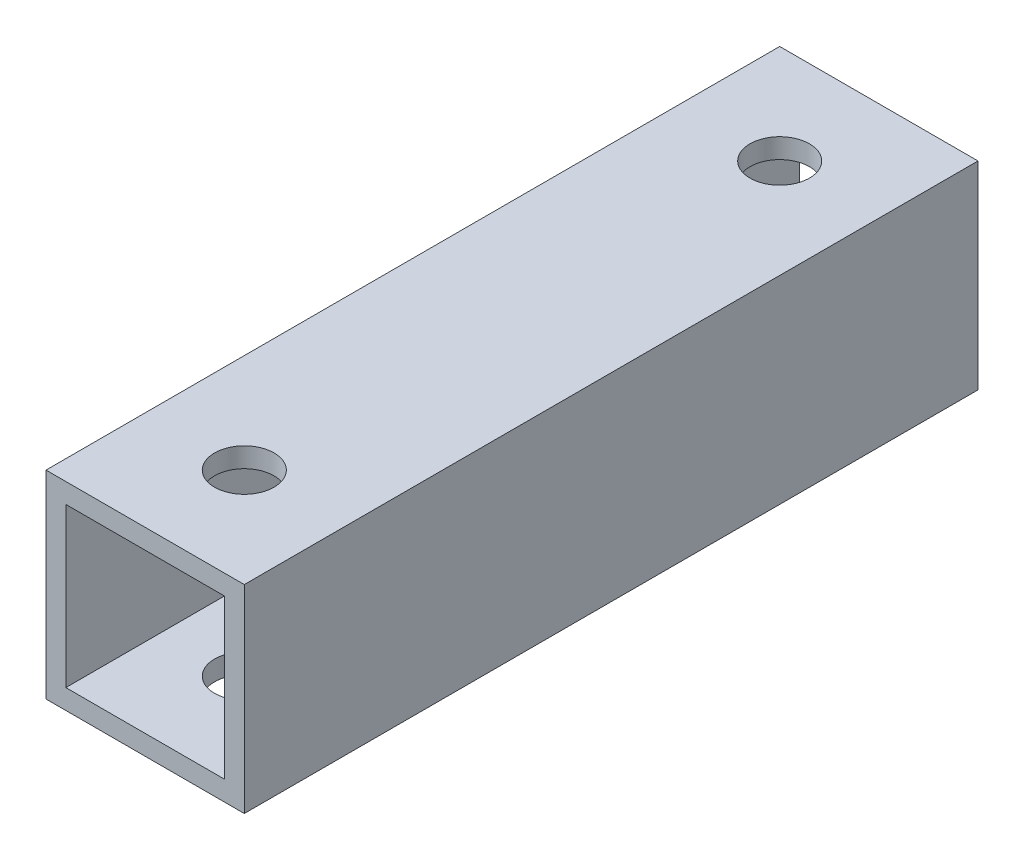
ISO-10303-21;
HEADER;
FILE_DESCRIPTION(('STEP AP214'),'2;1');
FILE_NAME('part.step','',(''),(''),'','','');
FILE_SCHEMA(('AUTOMOTIVE_DESIGN { 1 0 10303 214 1 1 1 1 }'));
ENDSEC;
DATA;
#1=APPLICATION_CONTEXT('core data for automotive mechanical design processes');
#2=APPLICATION_PROTOCOL_DEFINITION('international standard','automotive_design',2000,#1);
#3=PRODUCT_CONTEXT('',#1,'mechanical');
#4=PRODUCT('Part','Part','',(#3));
#5=PRODUCT_RELATED_PRODUCT_CATEGORY('part','',(#4));
#6=PRODUCT_DEFINITION_FORMATION('','',#4);
#7=PRODUCT_DEFINITION_CONTEXT('part definition',#1,'design');
#8=PRODUCT_DEFINITION('design','',#6,#7);
#9=PRODUCT_DEFINITION_SHAPE('','',#8);
#10=(LENGTH_UNIT() NAMED_UNIT(*) SI_UNIT(.MILLI.,.METRE.));
#11=(NAMED_UNIT(*) PLANE_ANGLE_UNIT() SI_UNIT($,.RADIAN.));
#12=(NAMED_UNIT(*) SI_UNIT($,.STERADIAN.) SOLID_ANGLE_UNIT());
#13=UNCERTAINTY_MEASURE_WITH_UNIT(LENGTH_MEASURE(1.E-05),#10,'distance_accuracy_value','');
#14=(GEOMETRIC_REPRESENTATION_CONTEXT(3) GLOBAL_UNCERTAINTY_ASSIGNED_CONTEXT((#13)) GLOBAL_UNIT_ASSIGNED_CONTEXT((#10,
#11,#12)) REPRESENTATION_CONTEXT('',''));
#15=CARTESIAN_POINT('',(0.,0.,0.));
#16=DIRECTION('',(0.,0.,1.));
#17=DIRECTION('',(1.,0.,0.));
#18=AXIS2_PLACEMENT_3D('',#15,#16,#17);
#19=CARTESIAN_POINT('',(0.,0.,37.));
#20=DIRECTION('',(0.,0.,1.));
#21=DIRECTION('',(1.,0.,0.));
#22=AXIS2_PLACEMENT_3D('',#19,#20,#21);
#23=PLANE('',#22);
#24=DIRECTION('',(0.,-1.,0.));
#25=VECTOR('',#24,1.);
#26=CARTESIAN_POINT('',(7.31776479123521,-99.5865047376337,37.));
#27=LINE('',#26,#25);
#28=CARTESIAN_POINT('',(7.31776479123521,-99.5865047376337,37.));
#29=VERTEX_POINT('',#28);
#30=CARTESIAN_POINT('',(7.31776479123521,-109.586504737634,37.));
#31=VERTEX_POINT('',#30);
#32=EDGE_CURVE('E167',#29,#31,#27,.T.);
#33=ORIENTED_EDGE('',*,*,#32,.T.);
#34=DIRECTION('',(1.,0.,0.));
#35=VECTOR('',#34,1.);
#36=CARTESIAN_POINT('',(7.31776479123521,-109.586504737634,37.));
#37=LINE('',#36,#35);
#38=CARTESIAN_POINT('',(17.3177647912352,-109.586504737634,37.));
#39=VERTEX_POINT('',#38);
#40=EDGE_CURVE('E170',#31,#39,#37,.T.);
#41=ORIENTED_EDGE('',*,*,#40,.T.);
#42=DIRECTION('',(0.,1.,0.));
#43=VECTOR('',#42,1.);
#44=CARTESIAN_POINT('',(17.3177647912352,-99.5865047376337,37.));
#45=LINE('',#44,#43);
#46=CARTESIAN_POINT('',(17.3177647912352,-99.5865047376337,37.));
#47=VERTEX_POINT('',#46);
#48=EDGE_CURVE('E173',#39,#47,#45,.T.);
#49=ORIENTED_EDGE('',*,*,#48,.T.);
#50=DIRECTION('',(-1.,0.,0.));
#51=VECTOR('',#50,1.);
#52=CARTESIAN_POINT('',(7.31776479123521,-99.5865047376337,37.));
#53=LINE('',#52,#51);
#54=EDGE_CURVE('E175',#47,#29,#53,.T.);
#55=ORIENTED_EDGE('',*,*,#54,.T.);
#56=EDGE_LOOP('',(#33,#41,#49,#55));
#57=FACE_BOUND('',#56,.T.);
#58=DIRECTION('',(1.,0.,0.));
#59=VECTOR('',#58,1.);
#60=CARTESIAN_POINT('',(7.31776479123521,-108.586504737634,37.));
#61=LINE('',#60,#59);
#62=CARTESIAN_POINT('',(8.31776479123521,-108.586504737634,37.));
#63=VERTEX_POINT('',#62);
#64=CARTESIAN_POINT('',(16.3177647912352,-108.586504737634,37.));
#65=VERTEX_POINT('',#64);
#66=EDGE_CURVE('E137',#63,#65,#61,.T.);
#67=ORIENTED_EDGE('',*,*,#66,.F.);
#68=DIRECTION('',(0.,-1.,0.));
#69=VECTOR('',#68,1.);
#70=CARTESIAN_POINT('',(8.31776479123521,-99.5865047376337,37.));
#71=LINE('',#70,#69);
#72=CARTESIAN_POINT('',(8.31776479123521,-100.586504737634,37.));
#73=VERTEX_POINT('',#72);
#74=EDGE_CURVE('E129',#73,#63,#71,.T.);
#75=ORIENTED_EDGE('',*,*,#74,.F.);
#76=DIRECTION('',(-1.,0.,0.));
#77=VECTOR('',#76,1.);
#78=CARTESIAN_POINT('',(7.31776479123521,-100.586504737634,37.));
#79=LINE('',#78,#77);
#80=CARTESIAN_POINT('',(16.3177647912352,-100.586504737634,37.));
#81=VERTEX_POINT('',#80);
#82=EDGE_CURVE('E151',#81,#73,#79,.T.);
#83=ORIENTED_EDGE('',*,*,#82,.F.);
#84=DIRECTION('',(0.,1.,0.));
#85=VECTOR('',#84,1.);
#86=CARTESIAN_POINT('',(16.3177647912352,-99.5865047376337,37.));
#87=LINE('',#86,#85);
#88=EDGE_CURVE('E149',#65,#81,#87,.T.);
#89=ORIENTED_EDGE('',*,*,#88,.F.);
#90=EDGE_LOOP('',(#67,#75,#83,#89));
#91=FACE_BOUND('',#90,.T.);
#92=ADVANCED_FACE('F62',(#57,#91),#23,.T.);
#93=CARTESIAN_POINT('',(0.,0.,0.));
#94=DIRECTION('',(0.,0.,1.));
#95=DIRECTION('',(1.,0.,0.));
#96=AXIS2_PLACEMENT_3D('',#93,#94,#95);
#97=PLANE('',#96);
#98=DIRECTION('',(0.,-1.,0.));
#99=VECTOR('',#98,1.);
#100=CARTESIAN_POINT('',(7.31776479123521,-99.5865047376337,0.));
#101=LINE('',#100,#99);
#102=CARTESIAN_POINT('',(7.31776479123521,-99.5865047376337,0.));
#103=VERTEX_POINT('',#102);
#104=CARTESIAN_POINT('',(7.31776479123521,-109.586504737634,0.));
#105=VERTEX_POINT('',#104);
#106=EDGE_CURVE('E145',#103,#105,#101,.T.);
#107=ORIENTED_EDGE('',*,*,#106,.F.);
#108=DIRECTION('',(-1.,0.,0.));
#109=VECTOR('',#108,1.);
#110=CARTESIAN_POINT('',(7.31776479123521,-99.5865047376337,0.));
#111=LINE('',#110,#109);
#112=CARTESIAN_POINT('',(17.3177647912352,-99.5865047376337,0.));
#113=VERTEX_POINT('',#112);
#114=EDGE_CURVE('E171',#113,#103,#111,.T.);
#115=ORIENTED_EDGE('',*,*,#114,.F.);
#116=DIRECTION('',(0.,1.,0.));
#117=VECTOR('',#116,1.);
#118=CARTESIAN_POINT('',(17.3177647912352,-99.5865047376337,0.));
#119=LINE('',#118,#117);
#120=CARTESIAN_POINT('',(17.3177647912352,-109.586504737634,0.));
#121=VERTEX_POINT('',#120);
#122=EDGE_CURVE('E182',#121,#113,#119,.T.);
#123=ORIENTED_EDGE('',*,*,#122,.F.);
#124=DIRECTION('',(1.,0.,0.));
#125=VECTOR('',#124,1.);
#126=CARTESIAN_POINT('',(7.31776479123521,-109.586504737634,0.));
#127=LINE('',#126,#125);
#128=EDGE_CURVE('E180',#105,#121,#127,.T.);
#129=ORIENTED_EDGE('',*,*,#128,.F.);
#130=EDGE_LOOP('',(#107,#115,#123,#129));
#131=FACE_BOUND('',#130,.T.);
#132=DIRECTION('',(0.,-1.,0.));
#133=VECTOR('',#132,1.);
#134=CARTESIAN_POINT('',(8.31776479123521,-99.5865047376337,0.));
#135=LINE('',#134,#133);
#136=CARTESIAN_POINT('',(8.31776479123521,-100.586504737634,0.));
#137=VERTEX_POINT('',#136);
#138=CARTESIAN_POINT('',(8.31776479123521,-108.586504737634,0.));
#139=VERTEX_POINT('',#138);
#140=EDGE_CURVE('E87',#137,#139,#135,.T.);
#141=ORIENTED_EDGE('',*,*,#140,.T.);
#142=DIRECTION('',(1.,0.,0.));
#143=VECTOR('',#142,1.);
#144=CARTESIAN_POINT('',(7.31776479123521,-108.586504737634,0.));
#145=LINE('',#144,#143);
#146=CARTESIAN_POINT('',(16.3177647912352,-108.586504737634,0.));
#147=VERTEX_POINT('',#146);
#148=EDGE_CURVE('E144',#139,#147,#145,.T.);
#149=ORIENTED_EDGE('',*,*,#148,.T.);
#150=DIRECTION('',(0.,1.,0.));
#151=VECTOR('',#150,1.);
#152=CARTESIAN_POINT('',(16.3177647912352,-99.5865047376337,0.));
#153=LINE('',#152,#151);
#154=CARTESIAN_POINT('',(16.3177647912352,-100.586504737634,0.));
#155=VERTEX_POINT('',#154);
#156=EDGE_CURVE('E159',#147,#155,#153,.T.);
#157=ORIENTED_EDGE('',*,*,#156,.T.);
#158=DIRECTION('',(-1.,0.,0.));
#159=VECTOR('',#158,1.);
#160=CARTESIAN_POINT('',(7.31776479123521,-100.586504737634,0.));
#161=LINE('',#160,#159);
#162=EDGE_CURVE('E138',#155,#137,#161,.T.);
#163=ORIENTED_EDGE('',*,*,#162,.T.);
#164=EDGE_LOOP('',(#141,#149,#157,#163));
#165=FACE_BOUND('',#164,.T.);
#166=ADVANCED_FACE('F229',(#131,#165),#97,.F.);
#167=CARTESIAN_POINT('',(7.31776479123521,-99.5865047376337,37.));
#168=DIRECTION('',(1.,0.,0.));
#169=DIRECTION('',(0.,1.,0.));
#170=AXIS2_PLACEMENT_3D('',#167,#168,#169);
#171=PLANE('',#170);
#172=ORIENTED_EDGE('',*,*,#106,.T.);
#173=DIRECTION('',(0.,0.,-1.));
#174=VECTOR('',#173,1.);
#175=CARTESIAN_POINT('',(7.31776479123521,-109.586504737634,37.));
#176=LINE('',#175,#174);
#177=EDGE_CURVE('E12',#31,#105,#176,.T.);
#178=ORIENTED_EDGE('',*,*,#177,.F.);
#179=ORIENTED_EDGE('',*,*,#32,.F.);
#180=DIRECTION('',(0.,0.,-1.));
#181=VECTOR('',#180,1.);
#182=CARTESIAN_POINT('',(7.31776479123521,-99.5865047376337,37.));
#183=LINE('',#182,#181);
#184=EDGE_CURVE('E177',#29,#103,#183,.T.);
#185=ORIENTED_EDGE('',*,*,#184,.T.);
#186=EDGE_LOOP('',(#172,#178,#179,#185));
#187=FACE_BOUND('',#186,.T.);
#188=ADVANCED_FACE('F64',(#187),#171,.F.);
#189=CARTESIAN_POINT('',(7.31776479123521,-109.586504737634,37.));
#190=DIRECTION('',(0.,1.,0.));
#191=DIRECTION('',(0.,0.,1.));
#192=AXIS2_PLACEMENT_3D('',#189,#190,#191);
#193=PLANE('',#192);
#194=CARTESIAN_POINT('',(12.3177647912352,-109.586504737634,5.));
#195=DIRECTION('',(0.,-1.,0.));
#196=DIRECTION('',(0.,0.,-1.));
#197=AXIS2_PLACEMENT_3D('',#194,#195,#196);
#198=CIRCLE('',#197,1.5);
#199=CARTESIAN_POINT('',(12.3177647912352,-109.586504737634,3.5));
#200=VERTEX_POINT('',#199);
#201=EDGE_CURVE('E200',#200,#200,#198,.T.);
#202=ORIENTED_EDGE('',*,*,#201,.F.);
#203=EDGE_LOOP('',(#202));
#204=FACE_BOUND('',#203,.T.);
#205=CARTESIAN_POINT('',(12.3177647912352,-109.586504737634,32.));
#206=DIRECTION('',(0.,-1.,0.));
#207=DIRECTION('',(0.,0.,-1.));
#208=AXIS2_PLACEMENT_3D('',#205,#206,#207);
#209=CIRCLE('',#208,1.5);
#210=CARTESIAN_POINT('',(12.3177647912352,-109.586504737634,30.5));
#211=VERTEX_POINT('',#210);
#212=EDGE_CURVE('E205',#211,#211,#209,.T.);
#213=ORIENTED_EDGE('',*,*,#212,.F.);
#214=EDGE_LOOP('',(#213));
#215=FACE_BOUND('',#214,.T.);
#216=ORIENTED_EDGE('',*,*,#128,.T.);
#217=DIRECTION('',(0.,0.,-1.));
#218=VECTOR('',#217,1.);
#219=CARTESIAN_POINT('',(17.3177647912352,-109.586504737634,37.));
#220=LINE('',#219,#218);
#221=EDGE_CURVE('E71',#39,#121,#220,.T.);
#222=ORIENTED_EDGE('',*,*,#221,.F.);
#223=ORIENTED_EDGE('',*,*,#40,.F.);
#224=ORIENTED_EDGE('',*,*,#177,.T.);
#225=EDGE_LOOP('',(#216,#222,#223,#224));
#226=FACE_BOUND('',#225,.T.);
#227=ADVANCED_FACE('F253',(#204,#215,#226),#193,.F.);
#228=CARTESIAN_POINT('',(17.3177647912352,-99.5865047376337,37.));
#229=DIRECTION('',(-1.,0.,0.));
#230=DIRECTION('',(0.,-1.,0.));
#231=AXIS2_PLACEMENT_3D('',#228,#229,#230);
#232=PLANE('',#231);
#233=ORIENTED_EDGE('',*,*,#122,.T.);
#234=DIRECTION('',(0.,0.,-1.));
#235=VECTOR('',#234,1.);
#236=CARTESIAN_POINT('',(17.3177647912352,-99.5865047376337,37.));
#237=LINE('',#236,#235);
#238=EDGE_CURVE('E187',#47,#113,#237,.T.);
#239=ORIENTED_EDGE('',*,*,#238,.F.);
#240=ORIENTED_EDGE('',*,*,#48,.F.);
#241=ORIENTED_EDGE('',*,*,#221,.T.);
#242=EDGE_LOOP('',(#233,#239,#240,#241));
#243=FACE_BOUND('',#242,.T.);
#244=ADVANCED_FACE('F251',(#243),#232,.F.);
#245=CARTESIAN_POINT('',(7.31776479123521,-99.5865047376337,37.));
#246=DIRECTION('',(0.,-1.,0.));
#247=DIRECTION('',(0.,0.,-1.));
#248=AXIS2_PLACEMENT_3D('',#245,#246,#247);
#249=PLANE('',#248);
#250=CARTESIAN_POINT('',(12.3177647912352,-99.5865047376337,5.));
#251=DIRECTION('',(0.,-1.,0.));
#252=DIRECTION('',(0.,0.,-1.));
#253=AXIS2_PLACEMENT_3D('',#250,#251,#252);
#254=CIRCLE('',#253,1.5);
#255=CARTESIAN_POINT('',(12.3177647912352,-99.5865047376337,3.5));
#256=VERTEX_POINT('',#255);
#257=EDGE_CURVE('E194',#256,#256,#254,.T.);
#258=ORIENTED_EDGE('',*,*,#257,.T.);
#259=EDGE_LOOP('',(#258));
#260=FACE_BOUND('',#259,.T.);
#261=CARTESIAN_POINT('',(12.3177647912352,-99.5865047376337,32.));
#262=DIRECTION('',(0.,-1.,0.));
#263=DIRECTION('',(0.,0.,-1.));
#264=AXIS2_PLACEMENT_3D('',#261,#262,#263);
#265=CIRCLE('',#264,1.5);
#266=CARTESIAN_POINT('',(12.3177647912352,-99.5865047376337,30.5));
#267=VERTEX_POINT('',#266);
#268=EDGE_CURVE('E210',#267,#267,#265,.T.);
#269=ORIENTED_EDGE('',*,*,#268,.T.);
#270=EDGE_LOOP('',(#269));
#271=FACE_BOUND('',#270,.T.);
#272=ORIENTED_EDGE('',*,*,#114,.T.);
#273=ORIENTED_EDGE('',*,*,#184,.F.);
#274=ORIENTED_EDGE('',*,*,#54,.F.);
#275=ORIENTED_EDGE('',*,*,#238,.T.);
#276=EDGE_LOOP('',(#272,#273,#274,#275));
#277=FACE_BOUND('',#276,.T.);
#278=ADVANCED_FACE('F248',(#260,#271,#277),#249,.F.);
#279=CARTESIAN_POINT('',(8.31776479123521,-99.5865047376337,37.));
#280=DIRECTION('',(1.,0.,0.));
#281=DIRECTION('',(0.,1.,0.));
#282=AXIS2_PLACEMENT_3D('',#279,#280,#281);
#283=PLANE('',#282);
#284=ORIENTED_EDGE('',*,*,#140,.F.);
#285=DIRECTION('',(0.,0.,-1.));
#286=VECTOR('',#285,1.);
#287=CARTESIAN_POINT('',(8.31776479123521,-100.586504737634,37.));
#288=LINE('',#287,#286);
#289=EDGE_CURVE('E133',#73,#137,#288,.T.);
#290=ORIENTED_EDGE('',*,*,#289,.F.);
#291=ORIENTED_EDGE('',*,*,#74,.T.);
#292=DIRECTION('',(0.,0.,-1.));
#293=VECTOR('',#292,1.);
#294=CARTESIAN_POINT('',(8.31776479123521,-108.586504737634,37.));
#295=LINE('',#294,#293);
#296=EDGE_CURVE('E132',#63,#139,#295,.T.);
#297=ORIENTED_EDGE('',*,*,#296,.T.);
#298=EDGE_LOOP('',(#284,#290,#291,#297));
#299=FACE_BOUND('',#298,.T.);
#300=ADVANCED_FACE('F131',(#299),#283,.T.);
#301=CARTESIAN_POINT('',(7.31776479123521,-108.586504737634,37.));
#302=DIRECTION('',(0.,1.,0.));
#303=DIRECTION('',(0.,0.,1.));
#304=AXIS2_PLACEMENT_3D('',#301,#302,#303);
#305=PLANE('',#304);
#306=CARTESIAN_POINT('',(12.3177647912352,-108.586504737634,5.));
#307=DIRECTION('',(0.,1.,0.));
#308=DIRECTION('',(0.,0.,1.));
#309=AXIS2_PLACEMENT_3D('',#306,#307,#308);
#310=CIRCLE('',#309,1.5);
#311=CARTESIAN_POINT('',(12.3177647912352,-108.586504737634,6.5));
#312=VERTEX_POINT('',#311);
#313=EDGE_CURVE('E157',#312,#312,#310,.T.);
#314=ORIENTED_EDGE('',*,*,#313,.F.);
#315=EDGE_LOOP('',(#314));
#316=FACE_BOUND('',#315,.T.);
#317=CARTESIAN_POINT('',(12.3177647912352,-108.586504737634,32.));
#318=DIRECTION('',(0.,1.,0.));
#319=DIRECTION('',(0.,0.,1.));
#320=AXIS2_PLACEMENT_3D('',#317,#318,#319);
#321=CIRCLE('',#320,1.5);
#322=CARTESIAN_POINT('',(12.3177647912352,-108.586504737634,33.5));
#323=VERTEX_POINT('',#322);
#324=EDGE_CURVE('E193',#323,#323,#321,.T.);
#325=ORIENTED_EDGE('',*,*,#324,.F.);
#326=EDGE_LOOP('',(#325));
#327=FACE_BOUND('',#326,.T.);
#328=ORIENTED_EDGE('',*,*,#148,.F.);
#329=ORIENTED_EDGE('',*,*,#296,.F.);
#330=ORIENTED_EDGE('',*,*,#66,.T.);
#331=DIRECTION('',(0.,0.,-1.));
#332=VECTOR('',#331,1.);
#333=CARTESIAN_POINT('',(16.3177647912352,-108.586504737634,37.));
#334=LINE('',#333,#332);
#335=EDGE_CURVE('E146',#65,#147,#334,.T.);
#336=ORIENTED_EDGE('',*,*,#335,.T.);
#337=EDGE_LOOP('',(#328,#329,#330,#336));
#338=FACE_BOUND('',#337,.T.);
#339=ADVANCED_FACE('F141',(#316,#327,#338),#305,.T.);
#340=CARTESIAN_POINT('',(16.3177647912352,-99.5865047376337,37.));
#341=DIRECTION('',(-1.,0.,0.));
#342=DIRECTION('',(0.,-1.,0.));
#343=AXIS2_PLACEMENT_3D('',#340,#341,#342);
#344=PLANE('',#343);
#345=ORIENTED_EDGE('',*,*,#156,.F.);
#346=ORIENTED_EDGE('',*,*,#335,.F.);
#347=ORIENTED_EDGE('',*,*,#88,.T.);
#348=DIRECTION('',(0.,0.,-1.));
#349=VECTOR('',#348,1.);
#350=CARTESIAN_POINT('',(16.3177647912352,-100.586504737634,37.));
#351=LINE('',#350,#349);
#352=EDGE_CURVE('E79',#81,#155,#351,.T.);
#353=ORIENTED_EDGE('',*,*,#352,.T.);
#354=EDGE_LOOP('',(#345,#346,#347,#353));
#355=FACE_BOUND('',#354,.T.);
#356=ADVANCED_FACE('F225',(#355),#344,.T.);
#357=CARTESIAN_POINT('',(7.31776479123521,-100.586504737634,37.));
#358=DIRECTION('',(0.,-1.,0.));
#359=DIRECTION('',(0.,0.,-1.));
#360=AXIS2_PLACEMENT_3D('',#357,#358,#359);
#361=PLANE('',#360);
#362=CARTESIAN_POINT('',(12.3177647912352,-100.586504737634,5.));
#363=DIRECTION('',(0.,-1.,0.));
#364=DIRECTION('',(0.,0.,-1.));
#365=AXIS2_PLACEMENT_3D('',#362,#363,#364);
#366=CIRCLE('',#365,1.5);
#367=CARTESIAN_POINT('',(12.3177647912352,-100.586504737634,3.5));
#368=VERTEX_POINT('',#367);
#369=EDGE_CURVE('E66',#368,#368,#366,.T.);
#370=ORIENTED_EDGE('',*,*,#369,.F.);
#371=EDGE_LOOP('',(#370));
#372=FACE_BOUND('',#371,.T.);
#373=CARTESIAN_POINT('',(12.3177647912352,-100.586504737634,32.));
#374=DIRECTION('',(0.,-1.,0.));
#375=DIRECTION('',(0.,0.,-1.));
#376=AXIS2_PLACEMENT_3D('',#373,#374,#375);
#377=CIRCLE('',#376,1.5);
#378=CARTESIAN_POINT('',(12.3177647912352,-100.586504737634,30.5));
#379=VERTEX_POINT('',#378);
#380=EDGE_CURVE('E191',#379,#379,#377,.T.);
#381=ORIENTED_EDGE('',*,*,#380,.F.);
#382=EDGE_LOOP('',(#381));
#383=FACE_BOUND('',#382,.T.);
#384=ORIENTED_EDGE('',*,*,#162,.F.);
#385=ORIENTED_EDGE('',*,*,#352,.F.);
#386=ORIENTED_EDGE('',*,*,#82,.T.);
#387=ORIENTED_EDGE('',*,*,#289,.T.);
#388=EDGE_LOOP('',(#384,#385,#386,#387));
#389=FACE_BOUND('',#388,.T.);
#390=ADVANCED_FACE('F221',(#372,#383,#389),#361,.T.);
#391=CARTESIAN_POINT('',(12.3177647912352,-99.5865047376337,32.));
#392=DIRECTION('',(0.,-1.,0.));
#393=DIRECTION('',(0.,0.,-1.));
#394=AXIS2_PLACEMENT_3D('',#391,#392,#393);
#395=CYLINDRICAL_SURFACE('',#394,1.5);
#396=ORIENTED_EDGE('',*,*,#380,.T.);
#397=EDGE_LOOP('',(#396));
#398=FACE_BOUND('',#397,.T.);
#399=ORIENTED_EDGE('',*,*,#268,.F.);
#400=EDGE_LOOP('',(#399));
#401=FACE_BOUND('',#400,.T.);
#402=ADVANCED_FACE('F224',(#398,#401),#395,.F.);
#403=CARTESIAN_POINT('',(12.3177647912352,-99.5865047376337,5.));
#404=DIRECTION('',(0.,-1.,0.));
#405=DIRECTION('',(0.,0.,-1.));
#406=AXIS2_PLACEMENT_3D('',#403,#404,#405);
#407=CYLINDRICAL_SURFACE('',#406,1.5);
#408=ORIENTED_EDGE('',*,*,#369,.T.);
#409=EDGE_LOOP('',(#408));
#410=FACE_BOUND('',#409,.T.);
#411=ORIENTED_EDGE('',*,*,#257,.F.);
#412=EDGE_LOOP('',(#411));
#413=FACE_BOUND('',#412,.T.);
#414=ADVANCED_FACE('F218',(#410,#413),#407,.F.);
#415=ORIENTED_EDGE('',*,*,#324,.T.);
#416=EDGE_LOOP('',(#415));
#417=FACE_BOUND('',#416,.T.);
#418=ORIENTED_EDGE('',*,*,#212,.T.);
#419=EDGE_LOOP('',(#418));
#420=FACE_BOUND('',#419,.T.);
#421=ADVANCED_FACE('F277',(#417,#420),#395,.F.);
#422=ORIENTED_EDGE('',*,*,#313,.T.);
#423=EDGE_LOOP('',(#422));
#424=FACE_BOUND('',#423,.T.);
#425=ORIENTED_EDGE('',*,*,#201,.T.);
#426=EDGE_LOOP('',(#425));
#427=FACE_BOUND('',#426,.T.);
#428=ADVANCED_FACE('F279',(#424,#427),#407,.F.);
#429=CLOSED_SHELL('',(#92,#166,#188,#227,#244,#278,#300,#339,#356,#390,#402,#414,#421,#428));
#430=MANIFOLD_SOLID_BREP('B2',#429);
#431=ADVANCED_BREP_SHAPE_REPRESENTATION('',(#18,#430),#14);
#432=SHAPE_DEFINITION_REPRESENTATION(#9,#431);
ENDSEC;
END-ISO-10303-21;
